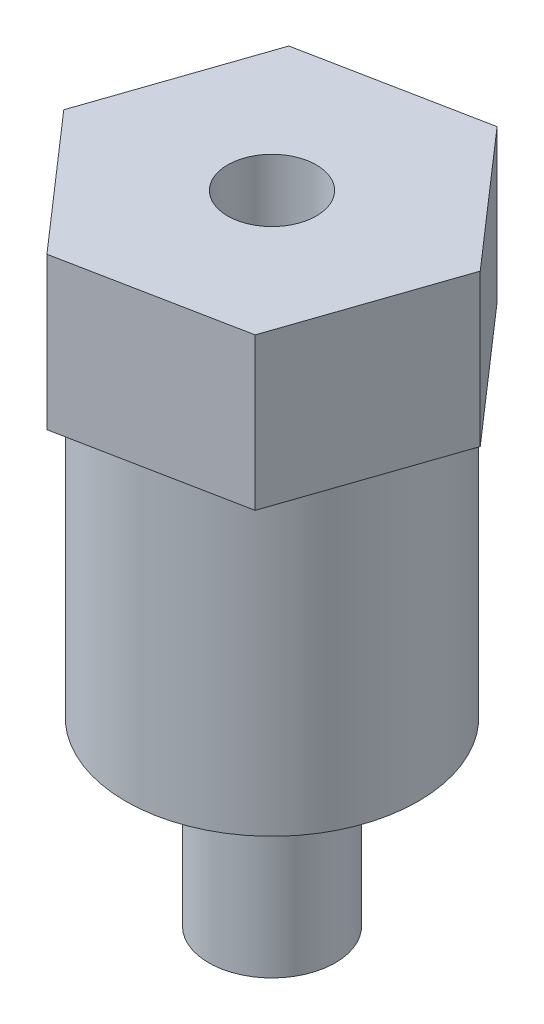
ISO-10303-21;
HEADER;
FILE_DESCRIPTION(('STEP AP214'),'2;1');
FILE_NAME('part.step','',(''),(''),'','','');
FILE_SCHEMA(('AUTOMOTIVE_DESIGN { 1 0 10303 214 1 1 1 1 }'));
ENDSEC;
DATA;
#1=APPLICATION_CONTEXT('core data for automotive mechanical design processes');
#2=APPLICATION_PROTOCOL_DEFINITION('international standard','automotive_design',2000,#1);
#3=PRODUCT_CONTEXT('',#1,'mechanical');
#4=PRODUCT('Part','Part','',(#3));
#5=PRODUCT_RELATED_PRODUCT_CATEGORY('part','',(#4));
#6=PRODUCT_DEFINITION_FORMATION('','',#4);
#7=PRODUCT_DEFINITION_CONTEXT('part definition',#1,'design');
#8=PRODUCT_DEFINITION('design','',#6,#7);
#9=PRODUCT_DEFINITION_SHAPE('','',#8);
#10=(LENGTH_UNIT() NAMED_UNIT(*) SI_UNIT(.MILLI.,.METRE.));
#11=(NAMED_UNIT(*) PLANE_ANGLE_UNIT() SI_UNIT($,.RADIAN.));
#12=(NAMED_UNIT(*) SI_UNIT($,.STERADIAN.) SOLID_ANGLE_UNIT());
#13=UNCERTAINTY_MEASURE_WITH_UNIT(LENGTH_MEASURE(1.E-05),#10,'distance_accuracy_value','');
#14=(GEOMETRIC_REPRESENTATION_CONTEXT(3) GLOBAL_UNCERTAINTY_ASSIGNED_CONTEXT((#13)) GLOBAL_UNIT_ASSIGNED_CONTEXT((#10,
#11,#12)) REPRESENTATION_CONTEXT('',''));
#15=CARTESIAN_POINT('',(0.,0.,0.));
#16=DIRECTION('',(0.,0.,1.));
#17=DIRECTION('',(1.,0.,0.));
#18=AXIS2_PLACEMENT_3D('',#15,#16,#17);
#19=CARTESIAN_POINT('',(-2.2620441662083,6.,6.62443629225332));
#20=DIRECTION('',(-0.19331863338684,0.,-0.981136028278161));
#21=DIRECTION('',(-0.981136028278161,0.,0.19331863338684));
#22=AXIS2_PLACEMENT_3D('',#19,#20,#21);
#23=PLANE('',#22);
#24=DIRECTION('',(0.981136028278161,0.,-0.19331863338684));
#25=VECTOR('',#24,1.);
#26=CARTESIAN_POINT('',(-2.2620441662083,0.,6.62443629225332));
#27=LINE('',#26,#25);
#28=CARTESIAN_POINT('',(-2.2620441662083,0.,6.62443629225332));
#29=VERTEX_POINT('',#28);
#30=CARTESIAN_POINT('',(4.60590803173882,0.,5.27120585854545));
#31=VERTEX_POINT('',#30);
#32=EDGE_CURVE('E126',#29,#31,#27,.T.);
#33=ORIENTED_EDGE('',*,*,#32,.T.);
#34=DIRECTION('',(0.,-1.,0.));
#35=VECTOR('',#34,1.);
#36=CARTESIAN_POINT('',(4.60590803173882,6.,5.27120585854545));
#37=LINE('',#36,#35);
#38=CARTESIAN_POINT('',(4.60590803173882,6.,5.27120585854545));
#39=VERTEX_POINT('',#38);
#40=EDGE_CURVE('E48',#39,#31,#37,.T.);
#41=ORIENTED_EDGE('',*,*,#40,.F.);
#42=DIRECTION('',(0.981136028278161,0.,-0.19331863338684));
#43=VECTOR('',#42,1.);
#44=CARTESIAN_POINT('',(-2.2620441662083,6.,6.62443629225332));
#45=LINE('',#44,#43);
#46=CARTESIAN_POINT('',(-2.2620441662083,6.,6.62443629225332));
#47=VERTEX_POINT('',#46);
#48=EDGE_CURVE('E136',#47,#39,#45,.T.);
#49=ORIENTED_EDGE('',*,*,#48,.F.);
#50=DIRECTION('',(0.,-1.,0.));
#51=VECTOR('',#50,1.);
#52=CARTESIAN_POINT('',(-2.2620441662083,6.,6.62443629225332));
#53=LINE('',#52,#51);
#54=EDGE_CURVE('E122',#47,#29,#53,.T.);
#55=ORIENTED_EDGE('',*,*,#54,.T.);
#56=EDGE_LOOP('',(#33,#41,#49,#55));
#57=FACE_BOUND('',#56,.T.);
#58=ADVANCED_FACE('F39',(#57),#23,.F.);
#59=CARTESIAN_POINT('',(4.60590803173882,6.,5.27120585854545));
#60=DIRECTION('',(-0.946348041750475,0.,-0.323149166601187));
#61=DIRECTION('',(-0.323149166601187,0.,0.946348041750475));
#62=AXIS2_PLACEMENT_3D('',#59,#60,#61);
#63=PLANE('',#62);
#64=DIRECTION('',(0.323149166601187,0.,-0.946348041750475));
#65=VECTOR('',#64,1.);
#66=CARTESIAN_POINT('',(4.60590803173882,0.,5.27120585854545));
#67=LINE('',#66,#65);
#68=CARTESIAN_POINT('',(6.86795219794713,0.,-1.35323043370788));
#69=VERTEX_POINT('',#68);
#70=EDGE_CURVE('E129',#31,#69,#67,.T.);
#71=ORIENTED_EDGE('',*,*,#70,.T.);
#72=DIRECTION('',(0.,-1.,0.));
#73=VECTOR('',#72,1.);
#74=CARTESIAN_POINT('',(6.86795219794713,6.,-1.35323043370788));
#75=LINE('',#74,#73);
#76=CARTESIAN_POINT('',(6.86795219794713,6.,-1.35323043370788));
#77=VERTEX_POINT('',#76);
#78=EDGE_CURVE('E140',#77,#69,#75,.T.);
#79=ORIENTED_EDGE('',*,*,#78,.F.);
#80=DIRECTION('',(0.323149166601187,0.,-0.946348041750475));
#81=VECTOR('',#80,1.);
#82=CARTESIAN_POINT('',(4.60590803173882,6.,5.27120585854545));
#83=LINE('',#82,#81);
#84=EDGE_CURVE('E95',#39,#77,#83,.T.);
#85=ORIENTED_EDGE('',*,*,#84,.F.);
#86=ORIENTED_EDGE('',*,*,#40,.T.);
#87=EDGE_LOOP('',(#71,#79,#85,#86));
#88=FACE_BOUND('',#87,.T.);
#89=ADVANCED_FACE('F143',(#88),#63,.F.);
#90=CARTESIAN_POINT('',(6.86795219794713,6.,-1.35323043370788));
#91=DIRECTION('',(-0.753029408363635,0.,0.657986861676974));
#92=DIRECTION('',(0.657986861676974,0.,0.753029408363635));
#93=AXIS2_PLACEMENT_3D('',#90,#91,#92);
#94=PLANE('',#93);
#95=DIRECTION('',(-0.657986861676974,0.,-0.753029408363635));
#96=VECTOR('',#95,1.);
#97=CARTESIAN_POINT('',(6.86795219794713,0.,-1.35323043370788));
#98=LINE('',#97,#96);
#99=CARTESIAN_POINT('',(2.26204416620831,0.,-6.62443629225332));
#100=VERTEX_POINT('',#99);
#101=EDGE_CURVE('E131',#69,#100,#98,.T.);
#102=ORIENTED_EDGE('',*,*,#101,.T.);
#103=DIRECTION('',(0.,-1.,0.));
#104=VECTOR('',#103,1.);
#105=CARTESIAN_POINT('',(2.26204416620831,6.,-6.62443629225332));
#106=LINE('',#105,#104);
#107=CARTESIAN_POINT('',(2.26204416620831,6.,-6.62443629225332));
#108=VERTEX_POINT('',#107);
#109=EDGE_CURVE('E117',#108,#100,#106,.T.);
#110=ORIENTED_EDGE('',*,*,#109,.F.);
#111=DIRECTION('',(-0.657986861676974,0.,-0.753029408363635));
#112=VECTOR('',#111,1.);
#113=CARTESIAN_POINT('',(6.86795219794713,6.,-1.35323043370788));
#114=LINE('',#113,#112);
#115=EDGE_CURVE('E108',#77,#108,#114,.T.);
#116=ORIENTED_EDGE('',*,*,#115,.F.);
#117=ORIENTED_EDGE('',*,*,#78,.T.);
#118=EDGE_LOOP('',(#102,#110,#116,#117));
#119=FACE_BOUND('',#118,.T.);
#120=ADVANCED_FACE('F151',(#119),#94,.F.);
#121=CARTESIAN_POINT('',(2.26204416620831,6.,-6.62443629225332));
#122=DIRECTION('',(0.19331863338684,0.,0.981136028278161));
#123=DIRECTION('',(0.981136028278161,0.,-0.19331863338684));
#124=AXIS2_PLACEMENT_3D('',#121,#122,#123);
#125=PLANE('',#124);
#126=DIRECTION('',(-0.981136028278161,0.,0.19331863338684));
#127=VECTOR('',#126,1.);
#128=CARTESIAN_POINT('',(2.26204416620831,0.,-6.62443629225332));
#129=LINE('',#128,#127);
#130=CARTESIAN_POINT('',(-4.60590803173882,0.,-5.27120585854544));
#131=VERTEX_POINT('',#130);
#132=EDGE_CURVE('E116',#100,#131,#129,.T.);
#133=ORIENTED_EDGE('',*,*,#132,.T.);
#134=DIRECTION('',(0.,-1.,0.));
#135=VECTOR('',#134,1.);
#136=CARTESIAN_POINT('',(-4.60590803173882,6.,-5.27120585854544));
#137=LINE('',#136,#135);
#138=CARTESIAN_POINT('',(-4.60590803173882,6.,-5.27120585854544));
#139=VERTEX_POINT('',#138);
#140=EDGE_CURVE('E113',#139,#131,#137,.T.);
#141=ORIENTED_EDGE('',*,*,#140,.F.);
#142=DIRECTION('',(-0.981136028278161,0.,0.19331863338684));
#143=VECTOR('',#142,1.);
#144=CARTESIAN_POINT('',(2.26204416620831,6.,-6.62443629225332));
#145=LINE('',#144,#143);
#146=EDGE_CURVE('E102',#108,#139,#145,.T.);
#147=ORIENTED_EDGE('',*,*,#146,.F.);
#148=ORIENTED_EDGE('',*,*,#109,.T.);
#149=EDGE_LOOP('',(#133,#141,#147,#148));
#150=FACE_BOUND('',#149,.T.);
#151=ADVANCED_FACE('F114',(#150),#125,.F.);
#152=CARTESIAN_POINT('',(-4.60590803173882,6.,-5.27120585854544));
#153=DIRECTION('',(0.946348041750475,0.,0.323149166601187));
#154=DIRECTION('',(0.323149166601187,0.,-0.946348041750475));
#155=AXIS2_PLACEMENT_3D('',#152,#153,#154);
#156=PLANE('',#155);
#157=DIRECTION('',(-0.323149166601187,0.,0.946348041750475));
#158=VECTOR('',#157,1.);
#159=CARTESIAN_POINT('',(-4.60590803173882,0.,-5.27120585854544));
#160=LINE('',#159,#158);
#161=CARTESIAN_POINT('',(-6.86795219794712,0.,1.35323043370788));
#162=VERTEX_POINT('',#161);
#163=EDGE_CURVE('E80',#131,#162,#160,.T.);
#164=ORIENTED_EDGE('',*,*,#163,.T.);
#165=DIRECTION('',(0.,-1.,0.));
#166=VECTOR('',#165,1.);
#167=CARTESIAN_POINT('',(-6.86795219794712,6.,1.35323043370788));
#168=LINE('',#167,#166);
#169=CARTESIAN_POINT('',(-6.86795219794712,6.,1.35323043370788));
#170=VERTEX_POINT('',#169);
#171=EDGE_CURVE('E118',#170,#162,#168,.T.);
#172=ORIENTED_EDGE('',*,*,#171,.F.);
#173=DIRECTION('',(-0.323149166601187,0.,0.946348041750475));
#174=VECTOR('',#173,1.);
#175=CARTESIAN_POINT('',(-4.60590803173882,6.,-5.27120585854544));
#176=LINE('',#175,#174);
#177=EDGE_CURVE('E106',#139,#170,#176,.T.);
#178=ORIENTED_EDGE('',*,*,#177,.F.);
#179=ORIENTED_EDGE('',*,*,#140,.T.);
#180=EDGE_LOOP('',(#164,#172,#178,#179));
#181=FACE_BOUND('',#180,.T.);
#182=ADVANCED_FACE('F120',(#181),#156,.F.);
#183=CARTESIAN_POINT('',(-6.86795219794712,6.,1.35323043370788));
#184=DIRECTION('',(0.753029408363635,0.,-0.657986861676974));
#185=DIRECTION('',(-0.657986861676974,0.,-0.753029408363635));
#186=AXIS2_PLACEMENT_3D('',#183,#184,#185);
#187=PLANE('',#186);
#188=DIRECTION('',(0.657986861676974,0.,0.753029408363635));
#189=VECTOR('',#188,1.);
#190=CARTESIAN_POINT('',(-6.86795219794712,0.,1.35323043370788));
#191=LINE('',#190,#189);
#192=EDGE_CURVE('E86',#162,#29,#191,.T.);
#193=ORIENTED_EDGE('',*,*,#192,.T.);
#194=ORIENTED_EDGE('',*,*,#54,.F.);
#195=DIRECTION('',(0.657986861676974,0.,0.753029408363635));
#196=VECTOR('',#195,1.);
#197=CARTESIAN_POINT('',(-6.86795219794712,6.,1.35323043370788));
#198=LINE('',#197,#196);
#199=EDGE_CURVE('E57',#170,#47,#198,.T.);
#200=ORIENTED_EDGE('',*,*,#199,.F.);
#201=ORIENTED_EDGE('',*,*,#171,.T.);
#202=EDGE_LOOP('',(#193,#194,#200,#201));
#203=FACE_BOUND('',#202,.T.);
#204=ADVANCED_FACE('F178',(#203),#187,.F.);
#205=CARTESIAN_POINT('',(0.,6.,0.));
#206=DIRECTION('',(0.,1.,0.));
#207=DIRECTION('',(0.,0.,1.));
#208=AXIS2_PLACEMENT_3D('',#205,#206,#207);
#209=PLANE('',#208);
#210=CARTESIAN_POINT('',(0.,6.,0.));
#211=DIRECTION('',(0.,1.,0.));
#212=DIRECTION('',(0.,0.,1.));
#213=AXIS2_PLACEMENT_3D('',#210,#211,#212);
#214=CIRCLE('',#213,1.75);
#215=CARTESIAN_POINT('',(0.,6.,1.75));
#216=VERTEX_POINT('',#215);
#217=EDGE_CURVE('E162',#216,#216,#214,.T.);
#218=ORIENTED_EDGE('',*,*,#217,.F.);
#219=EDGE_LOOP('',(#218));
#220=FACE_BOUND('',#219,.T.);
#221=ORIENTED_EDGE('',*,*,#48,.T.);
#222=ORIENTED_EDGE('',*,*,#84,.T.);
#223=ORIENTED_EDGE('',*,*,#115,.T.);
#224=ORIENTED_EDGE('',*,*,#146,.T.);
#225=ORIENTED_EDGE('',*,*,#177,.T.);
#226=ORIENTED_EDGE('',*,*,#199,.T.);
#227=EDGE_LOOP('',(#221,#222,#223,#224,#225,#226));
#228=FACE_BOUND('',#227,.T.);
#229=ADVANCED_FACE('F104',(#220,#228),#209,.T.);
#230=CARTESIAN_POINT('',(0.,0.,0.));
#231=DIRECTION('',(0.,1.,0.));
#232=DIRECTION('',(0.,0.,1.));
#233=AXIS2_PLACEMENT_3D('',#230,#231,#232);
#234=PLANE('',#233);
#235=CARTESIAN_POINT('',(0.,0.,0.));
#236=DIRECTION('',(0.,1.,0.));
#237=DIRECTION('',(0.,0.,1.));
#238=AXIS2_PLACEMENT_3D('',#235,#236,#237);
#239=CIRCLE('',#238,5.775);
#240=CARTESIAN_POINT('',(0.,0.,5.775));
#241=VERTEX_POINT('',#240);
#242=EDGE_CURVE('E42',#241,#241,#239,.T.);
#243=ORIENTED_EDGE('',*,*,#242,.T.);
#244=EDGE_LOOP('',(#243));
#245=FACE_BOUND('',#244,.T.);
#246=ORIENTED_EDGE('',*,*,#32,.F.);
#247=ORIENTED_EDGE('',*,*,#192,.F.);
#248=ORIENTED_EDGE('',*,*,#163,.F.);
#249=ORIENTED_EDGE('',*,*,#132,.F.);
#250=ORIENTED_EDGE('',*,*,#101,.F.);
#251=ORIENTED_EDGE('',*,*,#70,.F.);
#252=EDGE_LOOP('',(#246,#247,#248,#249,#250,#251));
#253=FACE_BOUND('',#252,.T.);
#254=ADVANCED_FACE('F148',(#245,#253),#234,.F.);
#255=CARTESIAN_POINT('',(0.,-12.,0.));
#256=DIRECTION('',(0.,1.,0.));
#257=DIRECTION('',(0.,0.,1.));
#258=AXIS2_PLACEMENT_3D('',#255,#256,#257);
#259=CYLINDRICAL_SURFACE('',#258,5.775);
#260=CARTESIAN_POINT('',(0.,-12.,0.));
#261=DIRECTION('',(0.,1.,0.));
#262=DIRECTION('',(0.,0.,1.));
#263=AXIS2_PLACEMENT_3D('',#260,#261,#262);
#264=CIRCLE('',#263,5.775);
#265=CARTESIAN_POINT('',(0.,-12.,5.775));
#266=VERTEX_POINT('',#265);
#267=EDGE_CURVE('E155',#266,#266,#264,.T.);
#268=ORIENTED_EDGE('',*,*,#267,.T.);
#269=EDGE_LOOP('',(#268));
#270=FACE_BOUND('',#269,.T.);
#271=ORIENTED_EDGE('',*,*,#242,.F.);
#272=EDGE_LOOP('',(#271));
#273=FACE_BOUND('',#272,.T.);
#274=ADVANCED_FACE('F184',(#270,#273),#259,.T.);
#275=CARTESIAN_POINT('',(0.,-12.,0.));
#276=DIRECTION('',(0.,1.,0.));
#277=DIRECTION('',(0.,0.,1.));
#278=AXIS2_PLACEMENT_3D('',#275,#276,#277);
#279=PLANE('',#278);
#280=CARTESIAN_POINT('',(0.,-12.,0.));
#281=DIRECTION('',(0.,-1.,0.));
#282=DIRECTION('',(0.,0.,-1.));
#283=AXIS2_PLACEMENT_3D('',#280,#281,#282);
#284=CIRCLE('',#283,2.5);
#285=CARTESIAN_POINT('',(0.,-12.,-2.5));
#286=VERTEX_POINT('',#285);
#287=EDGE_CURVE('E11',#286,#286,#284,.T.);
#288=ORIENTED_EDGE('',*,*,#287,.F.);
#289=EDGE_LOOP('',(#288));
#290=FACE_BOUND('',#289,.T.);
#291=ORIENTED_EDGE('',*,*,#267,.F.);
#292=EDGE_LOOP('',(#291));
#293=FACE_BOUND('',#292,.T.);
#294=ADVANCED_FACE('F263',(#290,#293),#279,.F.);
#295=CARTESIAN_POINT('',(0.,-19.16,0.));
#296=DIRECTION('',(0.,1.,0.));
#297=DIRECTION('',(0.,0.,1.));
#298=AXIS2_PLACEMENT_3D('',#295,#296,#297);
#299=CYLINDRICAL_SURFACE('',#298,2.5);
#300=CARTESIAN_POINT('',(0.,-19.16,0.));
#301=DIRECTION('',(0.,-1.,0.));
#302=DIRECTION('',(0.,0.,-1.));
#303=AXIS2_PLACEMENT_3D('',#300,#301,#302);
#304=CIRCLE('',#303,2.5);
#305=CARTESIAN_POINT('',(0.,-19.16,-2.5));
#306=VERTEX_POINT('',#305);
#307=EDGE_CURVE('E157',#306,#306,#304,.T.);
#308=ORIENTED_EDGE('',*,*,#307,.F.);
#309=EDGE_LOOP('',(#308));
#310=FACE_BOUND('',#309,.T.);
#311=ORIENTED_EDGE('',*,*,#287,.T.);
#312=EDGE_LOOP('',(#311));
#313=FACE_BOUND('',#312,.T.);
#314=ADVANCED_FACE('F271',(#310,#313),#299,.T.);
#315=CARTESIAN_POINT('',(0.,-19.16,0.));
#316=DIRECTION('',(0.,-1.,0.));
#317=DIRECTION('',(0.,0.,-1.));
#318=AXIS2_PLACEMENT_3D('',#315,#316,#317);
#319=PLANE('',#318);
#320=ORIENTED_EDGE('',*,*,#307,.T.);
#321=EDGE_LOOP('',(#320));
#322=FACE_BOUND('',#321,.T.);
#323=ADVANCED_FACE('F173',(#322),#319,.T.);
#324=CARTESIAN_POINT('',(0.,-4.,0.));
#325=DIRECTION('',(0.,1.,0.));
#326=DIRECTION('',(0.,0.,1.));
#327=AXIS2_PLACEMENT_3D('',#324,#325,#326);
#328=CYLINDRICAL_SURFACE('',#327,1.75);
#329=CARTESIAN_POINT('',(0.,-4.,0.));
#330=DIRECTION('',(0.,1.,0.));
#331=DIRECTION('',(0.,0.,1.));
#332=AXIS2_PLACEMENT_3D('',#329,#330,#331);
#333=CIRCLE('',#332,1.75);
#334=CARTESIAN_POINT('',(0.,-4.,1.75));
#335=VERTEX_POINT('',#334);
#336=EDGE_CURVE('E161',#335,#335,#333,.T.);
#337=ORIENTED_EDGE('',*,*,#336,.F.);
#338=EDGE_LOOP('',(#337));
#339=FACE_BOUND('',#338,.T.);
#340=ORIENTED_EDGE('',*,*,#217,.T.);
#341=EDGE_LOOP('',(#340));
#342=FACE_BOUND('',#341,.T.);
#343=ADVANCED_FACE('F170',(#339,#342),#328,.F.);
#344=CARTESIAN_POINT('',(0.,-4.,0.));
#345=DIRECTION('',(0.,1.,0.));
#346=DIRECTION('',(0.,0.,1.));
#347=AXIS2_PLACEMENT_3D('',#344,#345,#346);
#348=PLANE('',#347);
#349=ORIENTED_EDGE('',*,*,#336,.T.);
#350=EDGE_LOOP('',(#349));
#351=FACE_BOUND('',#350,.T.);
#352=ADVANCED_FACE('F168',(#351),#348,.T.);
#353=CLOSED_SHELL('',(#58,#89,#120,#151,#182,#204,#229,#254,#274,#294,#314,#323,#343,#352));
#354=MANIFOLD_SOLID_BREP('B2',#353);
#355=ADVANCED_BREP_SHAPE_REPRESENTATION('',(#18,#354),#14);
#356=SHAPE_DEFINITION_REPRESENTATION(#9,#355);
ENDSEC;
END-ISO-10303-21;
